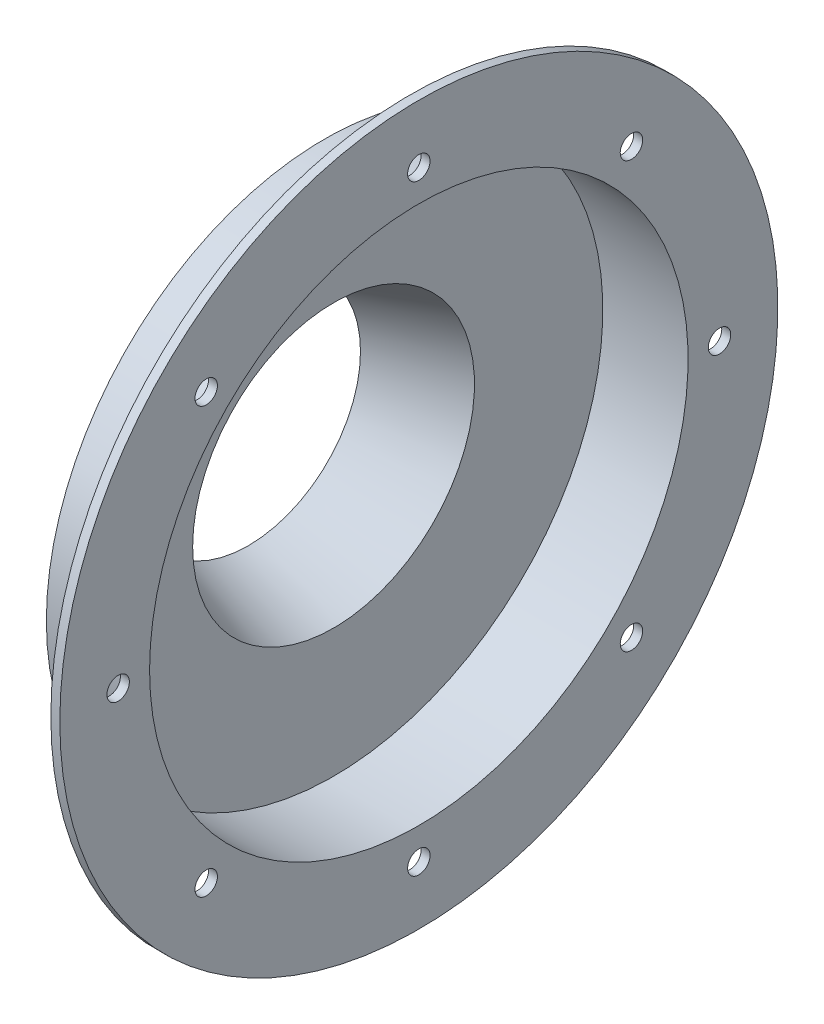
ISO-10303-21;
HEADER;
FILE_DESCRIPTION(('STEP AP214'),'2;1');
FILE_NAME('part.step','',(''),(''),'','','');
FILE_SCHEMA(('AUTOMOTIVE_DESIGN { 1 0 10303 214 1 1 1 1 }'));
ENDSEC;
DATA;
#1=APPLICATION_CONTEXT('core data for automotive mechanical design processes');
#2=APPLICATION_PROTOCOL_DEFINITION('international standard','automotive_design',2000,#1);
#3=PRODUCT_CONTEXT('',#1,'mechanical');
#4=PRODUCT('Part','Part','',(#3));
#5=PRODUCT_RELATED_PRODUCT_CATEGORY('part','',(#4));
#6=PRODUCT_DEFINITION_FORMATION('','',#4);
#7=PRODUCT_DEFINITION_CONTEXT('part definition',#1,'design');
#8=PRODUCT_DEFINITION('design','',#6,#7);
#9=PRODUCT_DEFINITION_SHAPE('','',#8);
#10=(LENGTH_UNIT() NAMED_UNIT(*) SI_UNIT(.MILLI.,.METRE.));
#11=(NAMED_UNIT(*) PLANE_ANGLE_UNIT() SI_UNIT($,.RADIAN.));
#12=(NAMED_UNIT(*) SI_UNIT($,.STERADIAN.) SOLID_ANGLE_UNIT());
#13=UNCERTAINTY_MEASURE_WITH_UNIT(LENGTH_MEASURE(1.E-05),#10,'distance_accuracy_value','');
#14=(GEOMETRIC_REPRESENTATION_CONTEXT(3) GLOBAL_UNCERTAINTY_ASSIGNED_CONTEXT((#13)) GLOBAL_UNIT_ASSIGNED_CONTEXT((#10,
#11,#12)) REPRESENTATION_CONTEXT('',''));
#15=CARTESIAN_POINT('',(0.,0.,0.));
#16=DIRECTION('',(0.,0.,1.));
#17=DIRECTION('',(1.,0.,0.));
#18=AXIS2_PLACEMENT_3D('',#15,#16,#17);
#19=CARTESIAN_POINT('',(-0.810815928492716,0.,0.));
#20=DIRECTION('',(-1.,0.,0.));
#21=DIRECTION('',(0.,0.,1.));
#22=AXIS2_PLACEMENT_3D('',#19,#20,#21);
#23=CONICAL_SURFACE('',#22,34.1571097877127,1.24589120872978);
#24=CARTESIAN_POINT('',(0.,0.,0.));
#25=DIRECTION('',(-1.,0.,0.));
#26=DIRECTION('',(0.,0.,1.));
#27=AXIS2_PLACEMENT_3D('',#24,#25,#26);
#28=CIRCLE('',#27,31.75);
#29=CARTESIAN_POINT('',(0.,0.,31.75));
#30=VERTEX_POINT('',#29);
#31=EDGE_CURVE('E10',#30,#30,#28,.T.);
#32=ORIENTED_EDGE('',*,*,#31,.F.);
#33=EDGE_LOOP('',(#32));
#34=FACE_BOUND('',#33,.T.);
#35=CARTESIAN_POINT('',(-0.810815928492716,0.,0.));
#36=DIRECTION('',(-1.,0.,0.));
#37=DIRECTION('',(0.,0.,1.));
#38=AXIS2_PLACEMENT_3D('',#35,#36,#37);
#39=CIRCLE('',#38,34.1571097877127);
#40=CARTESIAN_POINT('',(-0.810815928492716,0.,34.1571097877127));
#41=VERTEX_POINT('',#40);
#42=EDGE_CURVE('E72',#41,#41,#39,.T.);
#43=ORIENTED_EDGE('',*,*,#42,.T.);
#44=EDGE_LOOP('',(#43));
#45=FACE_BOUND('',#44,.T.);
#46=ADVANCED_FACE('F38',(#34,#45),#23,.F.);
#47=CARTESIAN_POINT('',(0.,0.,0.));
#48=DIRECTION('',(1.,0.,0.));
#49=DIRECTION('',(0.,0.,-1.));
#50=AXIS2_PLACEMENT_3D('',#47,#48,#49);
#51=CONICAL_SURFACE('',#50,31.75,0.324905118065119);
#52=CARTESIAN_POINT('',(24.13,0.,0.));
#53=DIRECTION('',(-1.,0.,0.));
#54=DIRECTION('',(0.,0.,1.));
#55=AXIS2_PLACEMENT_3D('',#52,#53,#54);
#56=CIRCLE('',#55,39.878);
#57=CARTESIAN_POINT('',(24.13,0.,39.878));
#58=VERTEX_POINT('',#57);
#59=EDGE_CURVE('E44',#58,#58,#56,.T.);
#60=ORIENTED_EDGE('',*,*,#59,.F.);
#61=EDGE_LOOP('',(#60));
#62=FACE_BOUND('',#61,.T.);
#63=ORIENTED_EDGE('',*,*,#31,.T.);
#64=EDGE_LOOP('',(#63));
#65=FACE_BOUND('',#64,.T.);
#66=ADVANCED_FACE('F171',(#62,#65),#51,.F.);
#67=CARTESIAN_POINT('',(24.13,39.878,0.));
#68=DIRECTION('',(-1.,0.,0.));
#69=DIRECTION('',(0.,0.,1.));
#70=AXIS2_PLACEMENT_3D('',#67,#68,#69);
#71=PLANE('',#70);
#72=CARTESIAN_POINT('',(24.13,0.,0.));
#73=DIRECTION('',(-1.,0.,0.));
#74=DIRECTION('',(0.,0.,1.));
#75=AXIS2_PLACEMENT_3D('',#72,#73,#74);
#76=CIRCLE('',#75,76.2);
#77=CARTESIAN_POINT('',(24.13,0.,76.2));
#78=VERTEX_POINT('',#77);
#79=EDGE_CURVE('E48',#78,#78,#76,.T.);
#80=ORIENTED_EDGE('',*,*,#79,.F.);
#81=EDGE_LOOP('',(#80));
#82=FACE_BOUND('',#81,.T.);
#83=ORIENTED_EDGE('',*,*,#59,.T.);
#84=EDGE_LOOP('',(#83));
#85=FACE_BOUND('',#84,.T.);
#86=ADVANCED_FACE('F166',(#82,#85),#71,.F.);
#87=CARTESIAN_POINT('',(0.,0.,0.));
#88=DIRECTION('',(-1.,0.,0.));
#89=DIRECTION('',(0.,0.,1.));
#90=AXIS2_PLACEMENT_3D('',#87,#88,#89);
#91=CYLINDRICAL_SURFACE('',#90,76.2);
#92=CARTESIAN_POINT('',(48.26,0.,0.));
#93=DIRECTION('',(-1.,0.,0.));
#94=DIRECTION('',(0.,0.,1.));
#95=AXIS2_PLACEMENT_3D('',#92,#93,#94);
#96=CIRCLE('',#95,76.2);
#97=CARTESIAN_POINT('',(48.26,0.,76.2));
#98=VERTEX_POINT('',#97);
#99=EDGE_CURVE('E52',#98,#98,#96,.T.);
#100=ORIENTED_EDGE('',*,*,#99,.F.);
#101=EDGE_LOOP('',(#100));
#102=FACE_BOUND('',#101,.T.);
#103=ORIENTED_EDGE('',*,*,#79,.T.);
#104=EDGE_LOOP('',(#103));
#105=FACE_BOUND('',#104,.T.);
#106=ADVANCED_FACE('F159',(#102,#105),#91,.F.);
#107=CARTESIAN_POINT('',(48.26,76.2,0.));
#108=DIRECTION('',(-1.,0.,0.));
#109=DIRECTION('',(0.,0.,1.));
#110=AXIS2_PLACEMENT_3D('',#107,#108,#109);
#111=PLANE('',#110);
#112=CARTESIAN_POINT('',(48.26,-2.97090147122162E-13,-85.09));
#113=DIRECTION('',(-1.,0.,0.));
#114=DIRECTION('',(0.,1.,0.));
#115=AXIS2_PLACEMENT_3D('',#112,#113,#114);
#116=CIRCLE('',#115,3.175);
#117=CARTESIAN_POINT('',(48.26,3.1749999999997,-85.09));
#118=VERTEX_POINT('',#117);
#119=EDGE_CURVE('E85',#118,#118,#116,.T.);
#120=ORIENTED_EDGE('',*,*,#119,.T.);
#121=EDGE_LOOP('',(#120));
#122=FACE_BOUND('',#121,.T.);
#123=CARTESIAN_POINT('',(48.26,-60.1677160111636,-60.167716011163));
#124=DIRECTION('',(-1.,0.,0.));
#125=DIRECTION('',(0.,0.707106781186544,-0.707106781186551));
#126=AXIS2_PLACEMENT_3D('',#123,#124,#125);
#127=CIRCLE('',#126,3.175);
#128=CARTESIAN_POINT('',(48.26,-57.9226519808964,-62.4127800414303));
#129=VERTEX_POINT('',#128);
#130=EDGE_CURVE('E104',#129,#129,#127,.T.);
#131=ORIENTED_EDGE('',*,*,#130,.T.);
#132=EDGE_LOOP('',(#131));
#133=FACE_BOUND('',#132,.T.);
#134=CARTESIAN_POINT('',(48.26,-85.09,0.));
#135=DIRECTION('',(-1.,0.,0.));
#136=DIRECTION('',(0.,0.,-1.));
#137=AXIS2_PLACEMENT_3D('',#134,#135,#136);
#138=CIRCLE('',#137,3.175);
#139=CARTESIAN_POINT('',(48.26,-85.09,-3.175));
#140=VERTEX_POINT('',#139);
#141=EDGE_CURVE('E98',#140,#140,#138,.T.);
#142=ORIENTED_EDGE('',*,*,#141,.T.);
#143=EDGE_LOOP('',(#142));
#144=FACE_BOUND('',#143,.T.);
#145=CARTESIAN_POINT('',(48.26,-60.1677160111628,60.1677160111638));
#146=DIRECTION('',(-1.,0.,0.));
#147=DIRECTION('',(0.,-0.707106781186554,-0.707106781186541));
#148=AXIS2_PLACEMENT_3D('',#145,#146,#147);
#149=CIRCLE('',#148,3.175);
#150=CARTESIAN_POINT('',(48.26,-62.4127800414301,57.9226519808966));
#151=VERTEX_POINT('',#150);
#152=EDGE_CURVE('E91',#151,#151,#149,.T.);
#153=ORIENTED_EDGE('',*,*,#152,.T.);
#154=EDGE_LOOP('',(#153));
#155=FACE_BOUND('',#154,.T.);
#156=CARTESIAN_POINT('',(48.26,8.91270441366487E-13,85.09));
#157=DIRECTION('',(-1.,0.,0.));
#158=DIRECTION('',(0.,-1.,0.));
#159=AXIS2_PLACEMENT_3D('',#156,#157,#158);
#160=CIRCLE('',#159,3.175);
#161=CARTESIAN_POINT('',(48.26,-3.17499999999911,85.09));
#162=VERTEX_POINT('',#161);
#163=EDGE_CURVE('E92',#162,#162,#160,.T.);
#164=ORIENTED_EDGE('',*,*,#163,.T.);
#165=EDGE_LOOP('',(#164));
#166=FACE_BOUND('',#165,.T.);
#167=CARTESIAN_POINT('',(48.26,60.1677160111641,60.1677160111626));
#168=DIRECTION('',(-1.,0.,0.));
#169=DIRECTION('',(0.,-0.707106781186539,0.707106781186556));
#170=AXIS2_PLACEMENT_3D('',#167,#168,#169);
#171=CIRCLE('',#170,3.175);
#172=CARTESIAN_POINT('',(48.26,57.9226519808968,62.4127800414299));
#173=VERTEX_POINT('',#172);
#174=EDGE_CURVE('E115',#173,#173,#171,.T.);
#175=ORIENTED_EDGE('',*,*,#174,.T.);
#176=EDGE_LOOP('',(#175));
#177=FACE_BOUND('',#176,.T.);
#178=CARTESIAN_POINT('',(48.26,60.1677160111632,-60.1677160111634));
#179=DIRECTION('',(-1.,0.,0.));
#180=DIRECTION('',(0.,0.707106781186549,0.707106781186546));
#181=AXIS2_PLACEMENT_3D('',#178,#179,#180);
#182=CIRCLE('',#181,3.175);
#183=CARTESIAN_POINT('',(48.26,62.4127800414305,-57.9226519808961));
#184=VERTEX_POINT('',#183);
#185=EDGE_CURVE('E79',#184,#184,#182,.T.);
#186=ORIENTED_EDGE('',*,*,#185,.T.);
#187=EDGE_LOOP('',(#186));
#188=FACE_BOUND('',#187,.T.);
#189=CARTESIAN_POINT('',(48.26,85.09,0.));
#190=DIRECTION('',(-1.,0.,0.));
#191=DIRECTION('',(0.,0.,1.));
#192=AXIS2_PLACEMENT_3D('',#189,#190,#191);
#193=CIRCLE('',#192,3.175);
#194=CARTESIAN_POINT('',(48.26,85.09,3.175));
#195=VERTEX_POINT('',#194);
#196=EDGE_CURVE('E75',#195,#195,#193,.T.);
#197=ORIENTED_EDGE('',*,*,#196,.T.);
#198=EDGE_LOOP('',(#197));
#199=FACE_BOUND('',#198,.T.);
#200=CARTESIAN_POINT('',(48.26,0.,0.));
#201=DIRECTION('',(-1.,0.,0.));
#202=DIRECTION('',(0.,0.,1.));
#203=AXIS2_PLACEMENT_3D('',#200,#201,#202);
#204=CIRCLE('',#203,101.6);
#205=CARTESIAN_POINT('',(48.26,0.,101.6));
#206=VERTEX_POINT('',#205);
#207=EDGE_CURVE('E57',#206,#206,#204,.T.);
#208=ORIENTED_EDGE('',*,*,#207,.F.);
#209=EDGE_LOOP('',(#208));
#210=FACE_BOUND('',#209,.T.);
#211=ORIENTED_EDGE('',*,*,#99,.T.);
#212=EDGE_LOOP('',(#211));
#213=FACE_BOUND('',#212,.T.);
#214=ADVANCED_FACE('F124',(#122,#133,#144,#155,#166,#177,#188,#199,#210,#213),#111,.F.);
#215=CARTESIAN_POINT('',(0.,0.,0.));
#216=DIRECTION('',(-1.,0.,0.));
#217=DIRECTION('',(0.,0.,1.));
#218=AXIS2_PLACEMENT_3D('',#215,#216,#217);
#219=CYLINDRICAL_SURFACE('',#218,101.6);
#220=CARTESIAN_POINT('',(45.72,0.,0.));
#221=DIRECTION('',(-1.,0.,0.));
#222=DIRECTION('',(0.,0.,1.));
#223=AXIS2_PLACEMENT_3D('',#220,#221,#222);
#224=CIRCLE('',#223,101.6);
#225=CARTESIAN_POINT('',(45.72,0.,101.6));
#226=VERTEX_POINT('',#225);
#227=EDGE_CURVE('E60',#226,#226,#224,.T.);
#228=ORIENTED_EDGE('',*,*,#227,.F.);
#229=EDGE_LOOP('',(#228));
#230=FACE_BOUND('',#229,.T.);
#231=ORIENTED_EDGE('',*,*,#207,.T.);
#232=EDGE_LOOP('',(#231));
#233=FACE_BOUND('',#232,.T.);
#234=ADVANCED_FACE('F139',(#230,#233),#219,.T.);
#235=CARTESIAN_POINT('',(45.72,78.74,0.));
#236=DIRECTION('',(1.,0.,0.));
#237=DIRECTION('',(0.,0.,-1.));
#238=AXIS2_PLACEMENT_3D('',#235,#236,#237);
#239=PLANE('',#238);
#240=CARTESIAN_POINT('',(45.72,-2.97090147122162E-13,-85.09));
#241=DIRECTION('',(-1.,0.,0.));
#242=DIRECTION('',(0.,1.,0.));
#243=AXIS2_PLACEMENT_3D('',#240,#241,#242);
#244=CIRCLE('',#243,3.175);
#245=CARTESIAN_POINT('',(45.72,3.1749999999997,-85.09));
#246=VERTEX_POINT('',#245);
#247=EDGE_CURVE('E107',#246,#246,#244,.T.);
#248=ORIENTED_EDGE('',*,*,#247,.F.);
#249=EDGE_LOOP('',(#248));
#250=FACE_BOUND('',#249,.T.);
#251=CARTESIAN_POINT('',(45.72,-60.1677160111636,-60.167716011163));
#252=DIRECTION('',(-1.,0.,0.));
#253=DIRECTION('',(0.,0.707106781186544,-0.707106781186551));
#254=AXIS2_PLACEMENT_3D('',#251,#252,#253);
#255=CIRCLE('',#254,3.175);
#256=CARTESIAN_POINT('',(45.72,-57.9226519808964,-62.4127800414303));
#257=VERTEX_POINT('',#256);
#258=EDGE_CURVE('E101',#257,#257,#255,.T.);
#259=ORIENTED_EDGE('',*,*,#258,.F.);
#260=EDGE_LOOP('',(#259));
#261=FACE_BOUND('',#260,.T.);
#262=CARTESIAN_POINT('',(45.72,-85.09,0.));
#263=DIRECTION('',(-1.,0.,0.));
#264=DIRECTION('',(0.,0.,-1.));
#265=AXIS2_PLACEMENT_3D('',#262,#263,#264);
#266=CIRCLE('',#265,3.175);
#267=CARTESIAN_POINT('',(45.72,-85.09,-3.175));
#268=VERTEX_POINT('',#267);
#269=EDGE_CURVE('E95',#268,#268,#266,.T.);
#270=ORIENTED_EDGE('',*,*,#269,.F.);
#271=EDGE_LOOP('',(#270));
#272=FACE_BOUND('',#271,.T.);
#273=CARTESIAN_POINT('',(45.72,-60.1677160111628,60.1677160111638));
#274=DIRECTION('',(-1.,0.,0.));
#275=DIRECTION('',(0.,-0.707106781186554,-0.707106781186541));
#276=AXIS2_PLACEMENT_3D('',#273,#274,#275);
#277=CIRCLE('',#276,3.175);
#278=CARTESIAN_POINT('',(45.72,-62.4127800414301,57.9226519808966));
#279=VERTEX_POINT('',#278);
#280=EDGE_CURVE('E88',#279,#279,#277,.T.);
#281=ORIENTED_EDGE('',*,*,#280,.F.);
#282=EDGE_LOOP('',(#281));
#283=FACE_BOUND('',#282,.T.);
#284=CARTESIAN_POINT('',(45.72,8.91270441366487E-13,85.09));
#285=DIRECTION('',(-1.,0.,0.));
#286=DIRECTION('',(0.,-1.,0.));
#287=AXIS2_PLACEMENT_3D('',#284,#285,#286);
#288=CIRCLE('',#287,3.175);
#289=CARTESIAN_POINT('',(45.72,-3.17499999999911,85.09));
#290=VERTEX_POINT('',#289);
#291=EDGE_CURVE('E118',#290,#290,#288,.T.);
#292=ORIENTED_EDGE('',*,*,#291,.F.);
#293=EDGE_LOOP('',(#292));
#294=FACE_BOUND('',#293,.T.);
#295=CARTESIAN_POINT('',(45.72,60.1677160111641,60.1677160111626));
#296=DIRECTION('',(-1.,0.,0.));
#297=DIRECTION('',(0.,-0.707106781186539,0.707106781186556));
#298=AXIS2_PLACEMENT_3D('',#295,#296,#297);
#299=CIRCLE('',#298,3.175);
#300=CARTESIAN_POINT('',(45.72,57.9226519808968,62.4127800414299));
#301=VERTEX_POINT('',#300);
#302=EDGE_CURVE('E112',#301,#301,#299,.T.);
#303=ORIENTED_EDGE('',*,*,#302,.F.);
#304=EDGE_LOOP('',(#303));
#305=FACE_BOUND('',#304,.T.);
#306=CARTESIAN_POINT('',(45.72,60.1677160111632,-60.1677160111634));
#307=DIRECTION('',(-1.,0.,0.));
#308=DIRECTION('',(0.,0.707106781186549,0.707106781186546));
#309=AXIS2_PLACEMENT_3D('',#306,#307,#308);
#310=CIRCLE('',#309,3.175);
#311=CARTESIAN_POINT('',(45.72,62.4127800414305,-57.9226519808961));
#312=VERTEX_POINT('',#311);
#313=EDGE_CURVE('E82',#312,#312,#310,.T.);
#314=ORIENTED_EDGE('',*,*,#313,.F.);
#315=EDGE_LOOP('',(#314));
#316=FACE_BOUND('',#315,.T.);
#317=CARTESIAN_POINT('',(45.72,85.09,0.));
#318=DIRECTION('',(-1.,0.,0.));
#319=DIRECTION('',(0.,0.,1.));
#320=AXIS2_PLACEMENT_3D('',#317,#318,#319);
#321=CIRCLE('',#320,3.175);
#322=CARTESIAN_POINT('',(45.72,85.09,3.175));
#323=VERTEX_POINT('',#322);
#324=EDGE_CURVE('E76',#323,#323,#321,.T.);
#325=ORIENTED_EDGE('',*,*,#324,.F.);
#326=EDGE_LOOP('',(#325));
#327=FACE_BOUND('',#326,.T.);
#328=CARTESIAN_POINT('',(45.72,0.,0.));
#329=DIRECTION('',(-1.,0.,0.));
#330=DIRECTION('',(0.,0.,1.));
#331=AXIS2_PLACEMENT_3D('',#328,#329,#330);
#332=CIRCLE('',#331,78.74);
#333=CARTESIAN_POINT('',(45.72,0.,78.74));
#334=VERTEX_POINT('',#333);
#335=EDGE_CURVE('E63',#334,#334,#332,.T.);
#336=ORIENTED_EDGE('',*,*,#335,.F.);
#337=EDGE_LOOP('',(#336));
#338=FACE_BOUND('',#337,.T.);
#339=ORIENTED_EDGE('',*,*,#227,.T.);
#340=EDGE_LOOP('',(#339));
#341=FACE_BOUND('',#340,.T.);
#342=ADVANCED_FACE('F135',(#250,#261,#272,#283,#294,#305,#316,#327,#338,#341),#239,.F.);
#343=CARTESIAN_POINT('',(0.,0.,0.));
#344=DIRECTION('',(-1.,0.,0.));
#345=DIRECTION('',(0.,0.,1.));
#346=AXIS2_PLACEMENT_3D('',#343,#344,#345);
#347=CYLINDRICAL_SURFACE('',#346,78.74);
#348=CARTESIAN_POINT('',(21.59,0.,0.));
#349=DIRECTION('',(-1.,0.,0.));
#350=DIRECTION('',(0.,0.,1.));
#351=AXIS2_PLACEMENT_3D('',#348,#349,#350);
#352=CIRCLE('',#351,78.74);
#353=CARTESIAN_POINT('',(21.59,0.,78.74));
#354=VERTEX_POINT('',#353);
#355=EDGE_CURVE('E66',#354,#354,#352,.T.);
#356=ORIENTED_EDGE('',*,*,#355,.F.);
#357=EDGE_LOOP('',(#356));
#358=FACE_BOUND('',#357,.T.);
#359=ORIENTED_EDGE('',*,*,#335,.T.);
#360=EDGE_LOOP('',(#359));
#361=FACE_BOUND('',#360,.T.);
#362=ADVANCED_FACE('F138',(#358,#361),#347,.T.);
#363=CARTESIAN_POINT('',(21.59,41.7026477846787,0.));
#364=DIRECTION('',(1.,0.,0.));
#365=DIRECTION('',(0.,0.,-1.));
#366=AXIS2_PLACEMENT_3D('',#363,#364,#365);
#367=PLANE('',#366);
#368=CARTESIAN_POINT('',(21.59,0.,0.));
#369=DIRECTION('',(-1.,0.,0.));
#370=DIRECTION('',(0.,0.,1.));
#371=AXIS2_PLACEMENT_3D('',#368,#369,#370);
#372=CIRCLE('',#371,41.7026477846787);
#373=CARTESIAN_POINT('',(21.59,0.,41.7026477846787));
#374=VERTEX_POINT('',#373);
#375=EDGE_CURVE('E69',#374,#374,#372,.T.);
#376=ORIENTED_EDGE('',*,*,#375,.F.);
#377=EDGE_LOOP('',(#376));
#378=FACE_BOUND('',#377,.T.);
#379=ORIENTED_EDGE('',*,*,#355,.T.);
#380=EDGE_LOOP('',(#379));
#381=FACE_BOUND('',#380,.T.);
#382=ADVANCED_FACE('F188',(#378,#381),#367,.F.);
#383=CARTESIAN_POINT('',(21.59,0.,0.));
#384=DIRECTION('',(1.,0.,0.));
#385=DIRECTION('',(0.,0.,-1.));
#386=AXIS2_PLACEMENT_3D('',#383,#384,#385);
#387=CONICAL_SURFACE('',#386,41.7026477846787,0.324905118065119);
#388=ORIENTED_EDGE('',*,*,#42,.F.);
#389=EDGE_LOOP('',(#388));
#390=FACE_BOUND('',#389,.T.);
#391=ORIENTED_EDGE('',*,*,#375,.T.);
#392=EDGE_LOOP('',(#391));
#393=FACE_BOUND('',#392,.T.);
#394=ADVANCED_FACE('F184',(#390,#393),#387,.T.);
#395=CARTESIAN_POINT('',(48.26,85.09,0.));
#396=DIRECTION('',(-1.,0.,0.));
#397=DIRECTION('',(0.,0.,1.));
#398=AXIS2_PLACEMENT_3D('',#395,#396,#397);
#399=CYLINDRICAL_SURFACE('',#398,3.175);
#400=ORIENTED_EDGE('',*,*,#196,.F.);
#401=EDGE_LOOP('',(#400));
#402=FACE_BOUND('',#401,.T.);
#403=ORIENTED_EDGE('',*,*,#324,.T.);
#404=EDGE_LOOP('',(#403));
#405=FACE_BOUND('',#404,.T.);
#406=ADVANCED_FACE('F187',(#402,#405),#399,.F.);
#407=CARTESIAN_POINT('',(48.26,60.1677160111632,-60.1677160111634));
#408=DIRECTION('',(-1.,0.,0.));
#409=DIRECTION('',(0.,0.,1.));
#410=AXIS2_PLACEMENT_3D('',#407,#408,#409);
#411=CYLINDRICAL_SURFACE('',#410,3.175);
#412=ORIENTED_EDGE('',*,*,#185,.F.);
#413=EDGE_LOOP('',(#412));
#414=FACE_BOUND('',#413,.T.);
#415=ORIENTED_EDGE('',*,*,#313,.T.);
#416=EDGE_LOOP('',(#415));
#417=FACE_BOUND('',#416,.T.);
#418=ADVANCED_FACE('F205',(#414,#417),#411,.F.);
#419=CARTESIAN_POINT('',(48.26,60.1677160111641,60.1677160111626));
#420=DIRECTION('',(-1.,0.,0.));
#421=DIRECTION('',(0.,0.,1.));
#422=AXIS2_PLACEMENT_3D('',#419,#420,#421);
#423=CYLINDRICAL_SURFACE('',#422,3.175);
#424=ORIENTED_EDGE('',*,*,#174,.F.);
#425=EDGE_LOOP('',(#424));
#426=FACE_BOUND('',#425,.T.);
#427=ORIENTED_EDGE('',*,*,#302,.T.);
#428=EDGE_LOOP('',(#427));
#429=FACE_BOUND('',#428,.T.);
#430=ADVANCED_FACE('F131',(#426,#429),#423,.F.);
#431=CARTESIAN_POINT('',(48.26,8.91270441366487E-13,85.09));
#432=DIRECTION('',(-1.,0.,0.));
#433=DIRECTION('',(0.,0.,1.));
#434=AXIS2_PLACEMENT_3D('',#431,#432,#433);
#435=CYLINDRICAL_SURFACE('',#434,3.175);
#436=ORIENTED_EDGE('',*,*,#163,.F.);
#437=EDGE_LOOP('',(#436));
#438=FACE_BOUND('',#437,.T.);
#439=ORIENTED_EDGE('',*,*,#291,.T.);
#440=EDGE_LOOP('',(#439));
#441=FACE_BOUND('',#440,.T.);
#442=ADVANCED_FACE('F127',(#438,#441),#435,.F.);
#443=CARTESIAN_POINT('',(48.26,-60.1677160111628,60.1677160111638));
#444=DIRECTION('',(-1.,0.,0.));
#445=DIRECTION('',(0.,0.,1.));
#446=AXIS2_PLACEMENT_3D('',#443,#444,#445);
#447=CYLINDRICAL_SURFACE('',#446,3.175);
#448=ORIENTED_EDGE('',*,*,#152,.F.);
#449=EDGE_LOOP('',(#448));
#450=FACE_BOUND('',#449,.T.);
#451=ORIENTED_EDGE('',*,*,#280,.T.);
#452=EDGE_LOOP('',(#451));
#453=FACE_BOUND('',#452,.T.);
#454=ADVANCED_FACE('F130',(#450,#453),#447,.F.);
#455=CARTESIAN_POINT('',(48.26,-85.09,0.));
#456=DIRECTION('',(-1.,0.,0.));
#457=DIRECTION('',(0.,0.,1.));
#458=AXIS2_PLACEMENT_3D('',#455,#456,#457);
#459=CYLINDRICAL_SURFACE('',#458,3.175);
#460=ORIENTED_EDGE('',*,*,#141,.F.);
#461=EDGE_LOOP('',(#460));
#462=FACE_BOUND('',#461,.T.);
#463=ORIENTED_EDGE('',*,*,#269,.T.);
#464=EDGE_LOOP('',(#463));
#465=FACE_BOUND('',#464,.T.);
#466=ADVANCED_FACE('F212',(#462,#465),#459,.F.);
#467=CARTESIAN_POINT('',(48.26,-60.1677160111636,-60.167716011163));
#468=DIRECTION('',(-1.,0.,0.));
#469=DIRECTION('',(0.,0.,1.));
#470=AXIS2_PLACEMENT_3D('',#467,#468,#469);
#471=CYLINDRICAL_SURFACE('',#470,3.175);
#472=ORIENTED_EDGE('',*,*,#130,.F.);
#473=EDGE_LOOP('',(#472));
#474=FACE_BOUND('',#473,.T.);
#475=ORIENTED_EDGE('',*,*,#258,.T.);
#476=EDGE_LOOP('',(#475));
#477=FACE_BOUND('',#476,.T.);
#478=ADVANCED_FACE('F216',(#474,#477),#471,.F.);
#479=CARTESIAN_POINT('',(48.26,-2.97090147122162E-13,-85.09));
#480=DIRECTION('',(-1.,0.,0.));
#481=DIRECTION('',(0.,0.,1.));
#482=AXIS2_PLACEMENT_3D('',#479,#480,#481);
#483=CYLINDRICAL_SURFACE('',#482,3.175);
#484=ORIENTED_EDGE('',*,*,#119,.F.);
#485=EDGE_LOOP('',(#484));
#486=FACE_BOUND('',#485,.T.);
#487=ORIENTED_EDGE('',*,*,#247,.T.);
#488=EDGE_LOOP('',(#487));
#489=FACE_BOUND('',#488,.T.);
#490=ADVANCED_FACE('F220',(#486,#489),#483,.F.);
#491=CLOSED_SHELL('',(#46,#66,#86,#106,#214,#234,#342,#362,#382,#394,#406,#418,#430,#442,#454,
#466,#478,#490));
#492=MANIFOLD_SOLID_BREP('B2',#491);
#493=ADVANCED_BREP_SHAPE_REPRESENTATION('',(#18,#492),#14);
#494=SHAPE_DEFINITION_REPRESENTATION(#9,#493);
ENDSEC;
END-ISO-10303-21;
